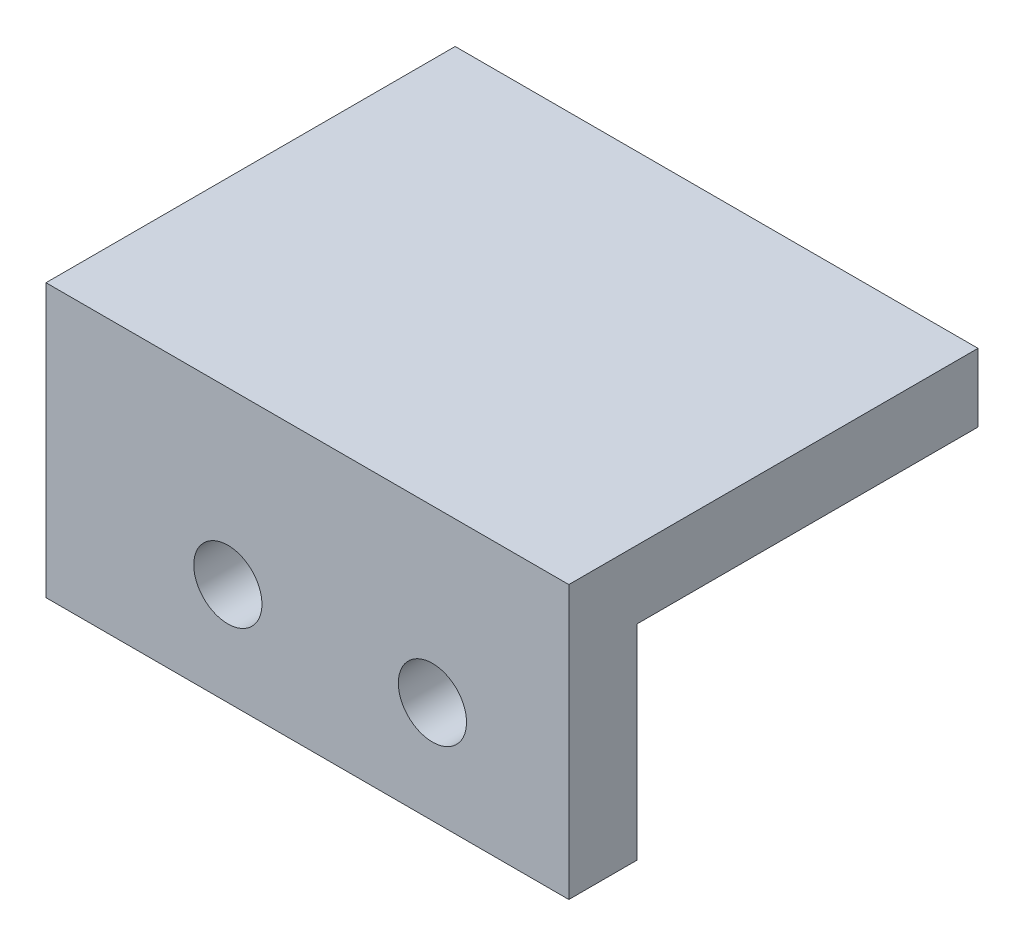
ISO-10303-21;
HEADER;
FILE_DESCRIPTION(('STEP AP214'),'2;1');
FILE_NAME('part.step','',(''),(''),'','','');
FILE_SCHEMA(('AUTOMOTIVE_DESIGN { 1 0 10303 214 1 1 1 1 }'));
ENDSEC;
DATA;
#1=APPLICATION_CONTEXT('core data for automotive mechanical design processes');
#2=APPLICATION_PROTOCOL_DEFINITION('international standard','automotive_design',2000,#1);
#3=PRODUCT_CONTEXT('',#1,'mechanical');
#4=PRODUCT('Part','Part','',(#3));
#5=PRODUCT_RELATED_PRODUCT_CATEGORY('part','',(#4));
#6=PRODUCT_DEFINITION_FORMATION('','',#4);
#7=PRODUCT_DEFINITION_CONTEXT('part definition',#1,'design');
#8=PRODUCT_DEFINITION('design','',#6,#7);
#9=PRODUCT_DEFINITION_SHAPE('','',#8);
#10=(LENGTH_UNIT() NAMED_UNIT(*) SI_UNIT(.MILLI.,.METRE.));
#11=(NAMED_UNIT(*) PLANE_ANGLE_UNIT() SI_UNIT($,.RADIAN.));
#12=(NAMED_UNIT(*) SI_UNIT($,.STERADIAN.) SOLID_ANGLE_UNIT());
#13=UNCERTAINTY_MEASURE_WITH_UNIT(LENGTH_MEASURE(1.E-05),#10,'distance_accuracy_value','');
#14=(GEOMETRIC_REPRESENTATION_CONTEXT(3) GLOBAL_UNCERTAINTY_ASSIGNED_CONTEXT((#13)) GLOBAL_UNIT_ASSIGNED_CONTEXT((#10,
#11,#12)) REPRESENTATION_CONTEXT('',''));
#15=CARTESIAN_POINT('',(0.,0.,0.));
#16=DIRECTION('',(0.,0.,1.));
#17=DIRECTION('',(1.,0.,0.));
#18=AXIS2_PLACEMENT_3D('',#15,#16,#17);
#19=CARTESIAN_POINT('',(-11.5,-6.,18.));
#20=DIRECTION('',(0.,1.,0.));
#21=DIRECTION('',(0.,0.,1.));
#22=AXIS2_PLACEMENT_3D('',#19,#20,#21);
#23=PLANE('',#22);
#24=DIRECTION('',(0.,0.,-1.));
#25=VECTOR('',#24,1.);
#26=CARTESIAN_POINT('',(-11.5,-6.,18.));
#27=LINE('',#26,#25);
#28=CARTESIAN_POINT('',(-11.5,-6.,18.));
#29=VERTEX_POINT('',#28);
#30=CARTESIAN_POINT('',(-11.5,-6.,15.));
#31=VERTEX_POINT('',#30);
#32=EDGE_CURVE('E169',#29,#31,#27,.T.);
#33=ORIENTED_EDGE('',*,*,#32,.T.);
#34=DIRECTION('',(1.,0.,0.));
#35=VECTOR('',#34,1.);
#36=CARTESIAN_POINT('',(-8.5,-6.,15.));
#37=LINE('',#36,#35);
#38=CARTESIAN_POINT('',(11.5,-6.,15.));
#39=VERTEX_POINT('',#38);
#40=EDGE_CURVE('E112',#31,#39,#37,.T.);
#41=ORIENTED_EDGE('',*,*,#40,.T.);
#42=DIRECTION('',(0.,0.,-1.));
#43=VECTOR('',#42,1.);
#44=CARTESIAN_POINT('',(11.5,-6.,18.));
#45=LINE('',#44,#43);
#46=CARTESIAN_POINT('',(11.5,-6.,18.));
#47=VERTEX_POINT('',#46);
#48=EDGE_CURVE('E157',#47,#39,#45,.T.);
#49=ORIENTED_EDGE('',*,*,#48,.F.);
#50=DIRECTION('',(1.,0.,0.));
#51=VECTOR('',#50,1.);
#52=CARTESIAN_POINT('',(-11.5,-6.,18.));
#53=LINE('',#52,#51);
#54=EDGE_CURVE('E155',#29,#47,#53,.T.);
#55=ORIENTED_EDGE('',*,*,#54,.F.);
#56=EDGE_LOOP('',(#33,#41,#49,#55));
#57=FACE_BOUND('',#56,.T.);
#58=ADVANCED_FACE('F32',(#57),#23,.F.);
#59=CARTESIAN_POINT('',(11.5,-6.,18.));
#60=DIRECTION('',(-1.,0.,0.));
#61=DIRECTION('',(0.,0.,1.));
#62=AXIS2_PLACEMENT_3D('',#59,#60,#61);
#63=PLANE('',#62);
#64=ORIENTED_EDGE('',*,*,#48,.T.);
#65=DIRECTION('',(0.,-1.,0.));
#66=VECTOR('',#65,1.);
#67=CARTESIAN_POINT('',(11.5,-6.,15.));
#68=LINE('',#67,#66);
#69=CARTESIAN_POINT('',(11.5,3.,15.));
#70=VERTEX_POINT('',#69);
#71=EDGE_CURVE('E138',#70,#39,#68,.T.);
#72=ORIENTED_EDGE('',*,*,#71,.F.);
#73=DIRECTION('',(0.,0.,1.));
#74=VECTOR('',#73,1.);
#75=CARTESIAN_POINT('',(11.5,3.,0.));
#76=LINE('',#75,#74);
#77=CARTESIAN_POINT('',(11.5,3.,0.));
#78=VERTEX_POINT('',#77);
#79=EDGE_CURVE('E109',#78,#70,#76,.T.);
#80=ORIENTED_EDGE('',*,*,#79,.F.);
#81=DIRECTION('',(0.,1.,0.));
#82=VECTOR('',#81,1.);
#83=CARTESIAN_POINT('',(11.5,-6.,0.));
#84=LINE('',#83,#82);
#85=CARTESIAN_POINT('',(11.5,6.,0.));
#86=VERTEX_POINT('',#85);
#87=EDGE_CURVE('E144',#78,#86,#84,.T.);
#88=ORIENTED_EDGE('',*,*,#87,.T.);
#89=DIRECTION('',(0.,0.,-1.));
#90=VECTOR('',#89,1.);
#91=CARTESIAN_POINT('',(11.5,6.,18.));
#92=LINE('',#91,#90);
#93=CARTESIAN_POINT('',(11.5,6.,18.));
#94=VERTEX_POINT('',#93);
#95=EDGE_CURVE('E40',#94,#86,#92,.T.);
#96=ORIENTED_EDGE('',*,*,#95,.F.);
#97=DIRECTION('',(0.,1.,0.));
#98=VECTOR('',#97,1.);
#99=CARTESIAN_POINT('',(11.5,-6.,18.));
#100=LINE('',#99,#98);
#101=EDGE_CURVE('E147',#47,#94,#100,.T.);
#102=ORIENTED_EDGE('',*,*,#101,.F.);
#103=EDGE_LOOP('',(#64,#72,#80,#88,#96,#102));
#104=FACE_BOUND('',#103,.T.);
#105=ADVANCED_FACE('F34',(#104),#63,.F.);
#106=CARTESIAN_POINT('',(-11.5,6.,18.));
#107=DIRECTION('',(0.,-1.,0.));
#108=DIRECTION('',(0.,0.,-1.));
#109=AXIS2_PLACEMENT_3D('',#106,#107,#108);
#110=PLANE('',#109);
#111=DIRECTION('',(-1.,0.,0.));
#112=VECTOR('',#111,1.);
#113=CARTESIAN_POINT('',(-11.5,6.,0.));
#114=LINE('',#113,#112);
#115=CARTESIAN_POINT('',(-11.5,6.,0.));
#116=VERTEX_POINT('',#115);
#117=EDGE_CURVE('E159',#86,#116,#114,.T.);
#118=ORIENTED_EDGE('',*,*,#117,.T.);
#119=DIRECTION('',(0.,0.,-1.));
#120=VECTOR('',#119,1.);
#121=CARTESIAN_POINT('',(-11.5,6.,18.));
#122=LINE('',#121,#120);
#123=CARTESIAN_POINT('',(-11.5,6.,18.));
#124=VERTEX_POINT('',#123);
#125=EDGE_CURVE('E171',#124,#116,#122,.T.);
#126=ORIENTED_EDGE('',*,*,#125,.F.);
#127=DIRECTION('',(-1.,0.,0.));
#128=VECTOR('',#127,1.);
#129=CARTESIAN_POINT('',(-11.5,6.,18.));
#130=LINE('',#129,#128);
#131=EDGE_CURVE('E150',#94,#124,#130,.T.);
#132=ORIENTED_EDGE('',*,*,#131,.F.);
#133=ORIENTED_EDGE('',*,*,#95,.T.);
#134=EDGE_LOOP('',(#118,#126,#132,#133));
#135=FACE_BOUND('',#134,.T.);
#136=ADVANCED_FACE('F176',(#135),#110,.F.);
#137=CARTESIAN_POINT('',(-11.5,-6.,18.));
#138=DIRECTION('',(1.,0.,0.));
#139=DIRECTION('',(0.,0.,-1.));
#140=AXIS2_PLACEMENT_3D('',#137,#138,#139);
#141=PLANE('',#140);
#142=DIRECTION('',(0.,0.,-1.));
#143=VECTOR('',#142,1.);
#144=CARTESIAN_POINT('',(-11.5,3.,15.));
#145=LINE('',#144,#143);
#146=CARTESIAN_POINT('',(-11.5,3.,15.));
#147=VERTEX_POINT('',#146);
#148=CARTESIAN_POINT('',(-11.5,3.,13.9));
#149=VERTEX_POINT('',#148);
#150=EDGE_CURVE('E106',#147,#149,#145,.T.);
#151=ORIENTED_EDGE('',*,*,#150,.F.);
#152=DIRECTION('',(0.,1.,0.));
#153=VECTOR('',#152,1.);
#154=CARTESIAN_POINT('',(-11.5,-6.,15.));
#155=LINE('',#154,#153);
#156=EDGE_CURVE('E116',#31,#147,#155,.T.);
#157=ORIENTED_EDGE('',*,*,#156,.F.);
#158=ORIENTED_EDGE('',*,*,#32,.F.);
#159=DIRECTION('',(0.,-1.,0.));
#160=VECTOR('',#159,1.);
#161=CARTESIAN_POINT('',(-11.5,-6.,18.));
#162=LINE('',#161,#160);
#163=EDGE_CURVE('E153',#124,#29,#162,.T.);
#164=ORIENTED_EDGE('',*,*,#163,.F.);
#165=ORIENTED_EDGE('',*,*,#125,.T.);
#166=DIRECTION('',(0.,-1.,0.));
#167=VECTOR('',#166,1.);
#168=CARTESIAN_POINT('',(-11.5,-6.,0.));
#169=LINE('',#168,#167);
#170=CARTESIAN_POINT('',(-11.5,-6.,0.));
#171=VERTEX_POINT('',#170);
#172=EDGE_CURVE('E161',#116,#171,#169,.T.);
#173=ORIENTED_EDGE('',*,*,#172,.T.);
#174=CARTESIAN_POINT('',(-11.5,-6.,13.9));
#175=VERTEX_POINT('',#174);
#176=EDGE_CURVE('E168',#175,#171,#27,.T.);
#177=ORIENTED_EDGE('',*,*,#176,.F.);
#178=DIRECTION('',(0.,-1.,0.));
#179=VECTOR('',#178,1.);
#180=CARTESIAN_POINT('',(-11.5,-6.,13.9));
#181=LINE('',#180,#179);
#182=EDGE_CURVE('E126',#149,#175,#181,.T.);
#183=ORIENTED_EDGE('',*,*,#182,.F.);
#184=EDGE_LOOP('',(#151,#157,#158,#164,#165,#173,#177,#183));
#185=FACE_BOUND('',#184,.T.);
#186=ADVANCED_FACE('F124',(#185),#141,.F.);
#187=DIRECTION('',(0.,0.,-1.));
#188=VECTOR('',#187,1.);
#189=CARTESIAN_POINT('',(-8.5,-6.,0.));
#190=LINE('',#189,#188);
#191=CARTESIAN_POINT('',(-8.5,-6.,13.9));
#192=VERTEX_POINT('',#191);
#193=CARTESIAN_POINT('',(-8.5,-6.,0.));
#194=VERTEX_POINT('',#193);
#195=EDGE_CURVE('E54',#192,#194,#190,.T.);
#196=ORIENTED_EDGE('',*,*,#195,.F.);
#197=DIRECTION('',(-1.,0.,0.));
#198=VECTOR('',#197,1.);
#199=CARTESIAN_POINT('',(11.5,-6.,13.9));
#200=LINE('',#199,#198);
#201=EDGE_CURVE('E131',#192,#175,#200,.T.);
#202=ORIENTED_EDGE('',*,*,#201,.T.);
#203=ORIENTED_EDGE('',*,*,#176,.T.);
#204=DIRECTION('',(1.,0.,0.));
#205=VECTOR('',#204,1.);
#206=CARTESIAN_POINT('',(-11.5,-6.,0.));
#207=LINE('',#206,#205);
#208=EDGE_CURVE('E151',#171,#194,#207,.T.);
#209=ORIENTED_EDGE('',*,*,#208,.T.);
#210=EDGE_LOOP('',(#196,#202,#203,#209));
#211=FACE_BOUND('',#210,.T.);
#212=ADVANCED_FACE('F195',(#211),#23,.F.);
#213=CARTESIAN_POINT('',(0.,0.,18.));
#214=DIRECTION('',(0.,0.,-1.));
#215=DIRECTION('',(-1.,0.,0.));
#216=AXIS2_PLACEMENT_3D('',#213,#214,#215);
#217=PLANE('',#216);
#218=CARTESIAN_POINT('',(-3.5,-1.5,18.));
#219=DIRECTION('',(0.,0.,-1.));
#220=DIRECTION('',(-1.,0.,0.));
#221=AXIS2_PLACEMENT_3D('',#218,#219,#220);
#222=CIRCLE('',#221,1.5);
#223=CARTESIAN_POINT('',(-5.,-1.5,18.));
#224=VERTEX_POINT('',#223);
#225=EDGE_CURVE('E314',#224,#224,#222,.T.);
#226=ORIENTED_EDGE('',*,*,#225,.T.);
#227=EDGE_LOOP('',(#226));
#228=FACE_BOUND('',#227,.T.);
#229=CARTESIAN_POINT('',(5.5,-1.5,18.));
#230=DIRECTION('',(0.,0.,-1.));
#231=DIRECTION('',(-1.,0.,0.));
#232=AXIS2_PLACEMENT_3D('',#229,#230,#231);
#233=CIRCLE('',#232,1.5);
#234=CARTESIAN_POINT('',(4.,-1.5,18.));
#235=VERTEX_POINT('',#234);
#236=EDGE_CURVE('E122',#235,#235,#233,.T.);
#237=ORIENTED_EDGE('',*,*,#236,.T.);
#238=EDGE_LOOP('',(#237));
#239=FACE_BOUND('',#238,.T.);
#240=ORIENTED_EDGE('',*,*,#101,.T.);
#241=ORIENTED_EDGE('',*,*,#131,.T.);
#242=ORIENTED_EDGE('',*,*,#163,.T.);
#243=ORIENTED_EDGE('',*,*,#54,.T.);
#244=EDGE_LOOP('',(#240,#241,#242,#243));
#245=FACE_BOUND('',#244,.T.);
#246=ADVANCED_FACE('F190',(#228,#239,#245),#217,.F.);
#247=CARTESIAN_POINT('',(0.,0.,0.));
#248=DIRECTION('',(0.,0.,-1.));
#249=DIRECTION('',(-1.,0.,0.));
#250=AXIS2_PLACEMENT_3D('',#247,#248,#249);
#251=PLANE('',#250);
#252=DIRECTION('',(1.,0.,0.));
#253=VECTOR('',#252,1.);
#254=CARTESIAN_POINT('',(-8.5,3.,0.));
#255=LINE('',#254,#253);
#256=CARTESIAN_POINT('',(-8.5,3.,0.));
#257=VERTEX_POINT('',#256);
#258=EDGE_CURVE('E113',#257,#78,#255,.T.);
#259=ORIENTED_EDGE('',*,*,#258,.F.);
#260=DIRECTION('',(0.,1.,0.));
#261=VECTOR('',#260,1.);
#262=CARTESIAN_POINT('',(-8.5,-6.,0.));
#263=LINE('',#262,#261);
#264=EDGE_CURVE('E135',#194,#257,#263,.T.);
#265=ORIENTED_EDGE('',*,*,#264,.F.);
#266=ORIENTED_EDGE('',*,*,#208,.F.);
#267=ORIENTED_EDGE('',*,*,#172,.F.);
#268=ORIENTED_EDGE('',*,*,#117,.F.);
#269=ORIENTED_EDGE('',*,*,#87,.F.);
#270=EDGE_LOOP('',(#259,#265,#266,#267,#268,#269));
#271=FACE_BOUND('',#270,.T.);
#272=ADVANCED_FACE('F185',(#271),#251,.T.);
#273=CARTESIAN_POINT('',(-8.5,-6.,15.));
#274=DIRECTION('',(0.,0.,1.));
#275=DIRECTION('',(1.,0.,0.));
#276=AXIS2_PLACEMENT_3D('',#273,#274,#275);
#277=PLANE('',#276);
#278=CARTESIAN_POINT('',(-3.5,-1.5,15.));
#279=DIRECTION('',(0.,0.,-1.));
#280=DIRECTION('',(-1.,0.,0.));
#281=AXIS2_PLACEMENT_3D('',#278,#279,#280);
#282=CIRCLE('',#281,1.5);
#283=CARTESIAN_POINT('',(-5.,-1.5,15.));
#284=VERTEX_POINT('',#283);
#285=EDGE_CURVE('E317',#284,#284,#282,.T.);
#286=ORIENTED_EDGE('',*,*,#285,.F.);
#287=EDGE_LOOP('',(#286));
#288=FACE_BOUND('',#287,.T.);
#289=CARTESIAN_POINT('',(5.5,-1.5,15.));
#290=DIRECTION('',(0.,0.,-1.));
#291=DIRECTION('',(-1.,0.,0.));
#292=AXIS2_PLACEMENT_3D('',#289,#290,#291);
#293=CIRCLE('',#292,1.5);
#294=CARTESIAN_POINT('',(4.,-1.5,15.));
#295=VERTEX_POINT('',#294);
#296=EDGE_CURVE('E319',#295,#295,#293,.T.);
#297=ORIENTED_EDGE('',*,*,#296,.F.);
#298=EDGE_LOOP('',(#297));
#299=FACE_BOUND('',#298,.T.);
#300=ORIENTED_EDGE('',*,*,#71,.T.);
#301=ORIENTED_EDGE('',*,*,#40,.F.);
#302=ORIENTED_EDGE('',*,*,#156,.T.);
#303=DIRECTION('',(1.,0.,0.));
#304=VECTOR('',#303,1.);
#305=CARTESIAN_POINT('',(-8.5,3.,15.));
#306=LINE('',#305,#304);
#307=EDGE_CURVE('E102',#147,#70,#306,.T.);
#308=ORIENTED_EDGE('',*,*,#307,.T.);
#309=EDGE_LOOP('',(#300,#301,#302,#308));
#310=FACE_BOUND('',#309,.T.);
#311=ADVANCED_FACE('F117',(#288,#299,#310),#277,.F.);
#312=CARTESIAN_POINT('',(-8.5,3.,0.));
#313=DIRECTION('',(0.,1.,0.));
#314=DIRECTION('',(0.,0.,1.));
#315=AXIS2_PLACEMENT_3D('',#312,#313,#314);
#316=PLANE('',#315);
#317=ORIENTED_EDGE('',*,*,#79,.T.);
#318=ORIENTED_EDGE('',*,*,#307,.F.);
#319=ORIENTED_EDGE('',*,*,#150,.T.);
#320=DIRECTION('',(-1.,0.,0.));
#321=VECTOR('',#320,1.);
#322=CARTESIAN_POINT('',(11.5,3.,13.9));
#323=LINE('',#322,#321);
#324=CARTESIAN_POINT('',(-8.5,3.,13.9));
#325=VERTEX_POINT('',#324);
#326=EDGE_CURVE('E47',#325,#149,#323,.T.);
#327=ORIENTED_EDGE('',*,*,#326,.F.);
#328=DIRECTION('',(0.,0.,1.));
#329=VECTOR('',#328,1.);
#330=CARTESIAN_POINT('',(-8.5,3.,0.));
#331=LINE('',#330,#329);
#332=EDGE_CURVE('E137',#257,#325,#331,.T.);
#333=ORIENTED_EDGE('',*,*,#332,.F.);
#334=ORIENTED_EDGE('',*,*,#258,.T.);
#335=EDGE_LOOP('',(#317,#318,#319,#327,#333,#334));
#336=FACE_BOUND('',#335,.T.);
#337=ADVANCED_FACE('F104',(#336),#316,.F.);
#338=CARTESIAN_POINT('',(-8.5,0.,0.));
#339=DIRECTION('',(1.,0.,0.));
#340=DIRECTION('',(0.,0.,-1.));
#341=AXIS2_PLACEMENT_3D('',#338,#339,#340);
#342=PLANE('',#341);
#343=DIRECTION('',(0.,1.,0.));
#344=VECTOR('',#343,1.);
#345=CARTESIAN_POINT('',(-8.5,0.,13.9));
#346=LINE('',#345,#344);
#347=EDGE_CURVE('E11',#192,#325,#346,.T.);
#348=ORIENTED_EDGE('',*,*,#347,.F.);
#349=ORIENTED_EDGE('',*,*,#195,.T.);
#350=ORIENTED_EDGE('',*,*,#264,.T.);
#351=ORIENTED_EDGE('',*,*,#332,.T.);
#352=EDGE_LOOP('',(#348,#349,#350,#351));
#353=FACE_BOUND('',#352,.T.);
#354=ADVANCED_FACE('F211',(#353),#342,.T.);
#355=CARTESIAN_POINT('',(11.5,-6.,13.9));
#356=DIRECTION('',(0.,0.,-1.));
#357=DIRECTION('',(0.,1.,0.));
#358=AXIS2_PLACEMENT_3D('',#355,#356,#357);
#359=PLANE('',#358);
#360=ORIENTED_EDGE('',*,*,#347,.T.);
#361=ORIENTED_EDGE('',*,*,#326,.T.);
#362=ORIENTED_EDGE('',*,*,#182,.T.);
#363=ORIENTED_EDGE('',*,*,#201,.F.);
#364=EDGE_LOOP('',(#360,#361,#362,#363));
#365=FACE_BOUND('',#364,.T.);
#366=ADVANCED_FACE('F210',(#365),#359,.F.);
#367=CARTESIAN_POINT('',(5.5,-1.5,18.));
#368=DIRECTION('',(0.,0.,-1.));
#369=DIRECTION('',(-1.,0.,0.));
#370=AXIS2_PLACEMENT_3D('',#367,#368,#369);
#371=CYLINDRICAL_SURFACE('',#370,1.5);
#372=ORIENTED_EDGE('',*,*,#236,.F.);
#373=EDGE_LOOP('',(#372));
#374=FACE_BOUND('',#373,.T.);
#375=ORIENTED_EDGE('',*,*,#296,.T.);
#376=EDGE_LOOP('',(#375));
#377=FACE_BOUND('',#376,.T.);
#378=ADVANCED_FACE('F218',(#374,#377),#371,.F.);
#379=CARTESIAN_POINT('',(-3.5,-1.5,18.));
#380=DIRECTION('',(0.,0.,-1.));
#381=DIRECTION('',(-1.,0.,0.));
#382=AXIS2_PLACEMENT_3D('',#379,#380,#381);
#383=CYLINDRICAL_SURFACE('',#382,1.5);
#384=ORIENTED_EDGE('',*,*,#225,.F.);
#385=EDGE_LOOP('',(#384));
#386=FACE_BOUND('',#385,.T.);
#387=ORIENTED_EDGE('',*,*,#285,.T.);
#388=EDGE_LOOP('',(#387));
#389=FACE_BOUND('',#388,.T.);
#390=ADVANCED_FACE('F298',(#386,#389),#383,.F.);
#391=CLOSED_SHELL('',(#58,#105,#136,#186,#212,#246,#272,#311,#337,#354,#366,#378,#390));
#392=MANIFOLD_SOLID_BREP('B2',#391);
#393=ADVANCED_BREP_SHAPE_REPRESENTATION('',(#18,#392),#14);
#394=SHAPE_DEFINITION_REPRESENTATION(#9,#393);
ENDSEC;
END-ISO-10303-21;
